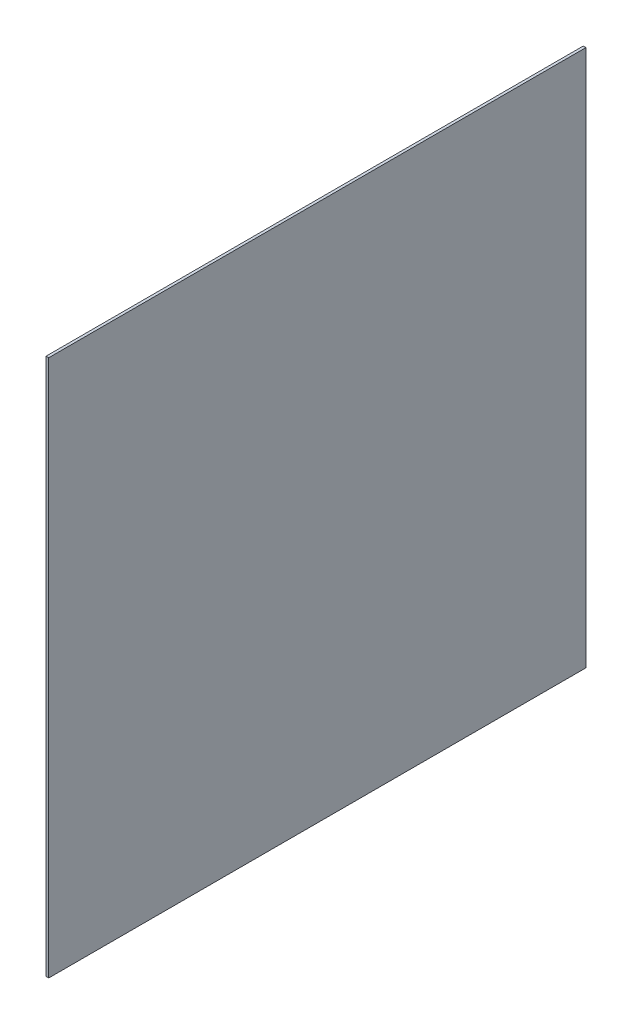
ISO-10303-21;
HEADER;
FILE_DESCRIPTION(('STEP AP214'),'2;1');
FILE_NAME('part.step','',(''),(''),'','','');
FILE_SCHEMA(('AUTOMOTIVE_DESIGN { 1 0 10303 214 1 1 1 1 }'));
ENDSEC;
DATA;
#1=APPLICATION_CONTEXT('core data for automotive mechanical design processes');
#2=APPLICATION_PROTOCOL_DEFINITION('international standard','automotive_design',2000,#1);
#3=PRODUCT_CONTEXT('',#1,'mechanical');
#4=PRODUCT('Part','Part','',(#3));
#5=PRODUCT_RELATED_PRODUCT_CATEGORY('part','',(#4));
#6=PRODUCT_DEFINITION_FORMATION('','',#4);
#7=PRODUCT_DEFINITION_CONTEXT('part definition',#1,'design');
#8=PRODUCT_DEFINITION('design','',#6,#7);
#9=PRODUCT_DEFINITION_SHAPE('','',#8);
#10=(LENGTH_UNIT() NAMED_UNIT(*) SI_UNIT(.MILLI.,.METRE.));
#11=(NAMED_UNIT(*) PLANE_ANGLE_UNIT() SI_UNIT($,.RADIAN.));
#12=(NAMED_UNIT(*) SI_UNIT($,.STERADIAN.) SOLID_ANGLE_UNIT());
#13=UNCERTAINTY_MEASURE_WITH_UNIT(LENGTH_MEASURE(1.E-05),#10,'distance_accuracy_value','');
#14=(GEOMETRIC_REPRESENTATION_CONTEXT(3) GLOBAL_UNCERTAINTY_ASSIGNED_CONTEXT((#13)) GLOBAL_UNIT_ASSIGNED_CONTEXT((#10,
#11,#12)) REPRESENTATION_CONTEXT('',''));
#15=CARTESIAN_POINT('',(0.,0.,0.));
#16=DIRECTION('',(0.,0.,1.));
#17=DIRECTION('',(1.,0.,0.));
#18=AXIS2_PLACEMENT_3D('',#15,#16,#17);
#19=CARTESIAN_POINT('',(1.,100.,100.));
#20=DIRECTION('',(0.,0.,-1.));
#21=DIRECTION('',(0.,1.,0.));
#22=AXIS2_PLACEMENT_3D('',#19,#20,#21);
#23=PLANE('',#22);
#24=DIRECTION('',(0.,-1.,0.));
#25=VECTOR('',#24,1.);
#26=CARTESIAN_POINT('',(0.,100.,100.));
#27=LINE('',#26,#25);
#28=CARTESIAN_POINT('',(0.,100.,100.));
#29=VERTEX_POINT('',#28);
#30=CARTESIAN_POINT('',(0.,-100.,100.));
#31=VERTEX_POINT('',#30);
#32=EDGE_CURVE('E97',#29,#31,#27,.T.);
#33=ORIENTED_EDGE('',*,*,#32,.T.);
#34=DIRECTION('',(-1.,0.,0.));
#35=VECTOR('',#34,1.);
#36=CARTESIAN_POINT('',(1.,-100.,100.));
#37=LINE('',#36,#35);
#38=CARTESIAN_POINT('',(1.,-100.,100.));
#39=VERTEX_POINT('',#38);
#40=EDGE_CURVE('E11',#39,#31,#37,.T.);
#41=ORIENTED_EDGE('',*,*,#40,.F.);
#42=DIRECTION('',(0.,-1.,0.));
#43=VECTOR('',#42,1.);
#44=CARTESIAN_POINT('',(1.,100.,100.));
#45=LINE('',#44,#43);
#46=CARTESIAN_POINT('',(1.,100.,100.));
#47=VERTEX_POINT('',#46);
#48=EDGE_CURVE('E85',#47,#39,#45,.T.);
#49=ORIENTED_EDGE('',*,*,#48,.F.);
#50=DIRECTION('',(-1.,0.,0.));
#51=VECTOR('',#50,1.);
#52=CARTESIAN_POINT('',(1.,100.,100.));
#53=LINE('',#52,#51);
#54=EDGE_CURVE('E93',#47,#29,#53,.T.);
#55=ORIENTED_EDGE('',*,*,#54,.T.);
#56=EDGE_LOOP('',(#33,#41,#49,#55));
#57=FACE_BOUND('',#56,.T.);
#58=ADVANCED_FACE('F34',(#57),#23,.F.);
#59=CARTESIAN_POINT('',(1.,-100.,100.));
#60=DIRECTION('',(0.,1.,0.));
#61=DIRECTION('',(0.,0.,1.));
#62=AXIS2_PLACEMENT_3D('',#59,#60,#61);
#63=PLANE('',#62);
#64=DIRECTION('',(0.,0.,-1.));
#65=VECTOR('',#64,1.);
#66=CARTESIAN_POINT('',(0.,-100.,100.));
#67=LINE('',#66,#65);
#68=CARTESIAN_POINT('',(0.,-100.,-100.));
#69=VERTEX_POINT('',#68);
#70=EDGE_CURVE('E89',#31,#69,#67,.T.);
#71=ORIENTED_EDGE('',*,*,#70,.T.);
#72=DIRECTION('',(-1.,0.,0.));
#73=VECTOR('',#72,1.);
#74=CARTESIAN_POINT('',(1.,-100.,-100.));
#75=LINE('',#74,#73);
#76=CARTESIAN_POINT('',(1.,-100.,-100.));
#77=VERTEX_POINT('',#76);
#78=EDGE_CURVE('E42',#77,#69,#75,.T.);
#79=ORIENTED_EDGE('',*,*,#78,.F.);
#80=DIRECTION('',(0.,0.,-1.));
#81=VECTOR('',#80,1.);
#82=CARTESIAN_POINT('',(1.,-100.,100.));
#83=LINE('',#82,#81);
#84=EDGE_CURVE('E80',#39,#77,#83,.T.);
#85=ORIENTED_EDGE('',*,*,#84,.F.);
#86=ORIENTED_EDGE('',*,*,#40,.T.);
#87=EDGE_LOOP('',(#71,#79,#85,#86));
#88=FACE_BOUND('',#87,.T.);
#89=ADVANCED_FACE('F88',(#88),#63,.F.);
#90=CARTESIAN_POINT('',(1.,100.,-100.));
#91=DIRECTION('',(0.,0.,1.));
#92=DIRECTION('',(0.,-1.,0.));
#93=AXIS2_PLACEMENT_3D('',#90,#91,#92);
#94=PLANE('',#93);
#95=DIRECTION('',(0.,1.,0.));
#96=VECTOR('',#95,1.);
#97=CARTESIAN_POINT('',(0.,100.,-100.));
#98=LINE('',#97,#96);
#99=CARTESIAN_POINT('',(0.,100.,-100.));
#100=VERTEX_POINT('',#99);
#101=EDGE_CURVE('E67',#69,#100,#98,.T.);
#102=ORIENTED_EDGE('',*,*,#101,.T.);
#103=DIRECTION('',(-1.,0.,0.));
#104=VECTOR('',#103,1.);
#105=CARTESIAN_POINT('',(1.,100.,-100.));
#106=LINE('',#105,#104);
#107=CARTESIAN_POINT('',(1.,100.,-100.));
#108=VERTEX_POINT('',#107);
#109=EDGE_CURVE('E90',#108,#100,#106,.T.);
#110=ORIENTED_EDGE('',*,*,#109,.F.);
#111=DIRECTION('',(0.,1.,0.));
#112=VECTOR('',#111,1.);
#113=CARTESIAN_POINT('',(1.,100.,-100.));
#114=LINE('',#113,#112);
#115=EDGE_CURVE('E83',#77,#108,#114,.T.);
#116=ORIENTED_EDGE('',*,*,#115,.F.);
#117=ORIENTED_EDGE('',*,*,#78,.T.);
#118=EDGE_LOOP('',(#102,#110,#116,#117));
#119=FACE_BOUND('',#118,.T.);
#120=ADVANCED_FACE('F91',(#119),#94,.F.);
#121=CARTESIAN_POINT('',(1.,100.,100.));
#122=DIRECTION('',(0.,-1.,0.));
#123=DIRECTION('',(0.,0.,-1.));
#124=AXIS2_PLACEMENT_3D('',#121,#122,#123);
#125=PLANE('',#124);
#126=DIRECTION('',(0.,0.,1.));
#127=VECTOR('',#126,1.);
#128=CARTESIAN_POINT('',(0.,100.,100.));
#129=LINE('',#128,#127);
#130=EDGE_CURVE('E73',#100,#29,#129,.T.);
#131=ORIENTED_EDGE('',*,*,#130,.T.);
#132=ORIENTED_EDGE('',*,*,#54,.F.);
#133=DIRECTION('',(0.,0.,1.));
#134=VECTOR('',#133,1.);
#135=CARTESIAN_POINT('',(1.,100.,100.));
#136=LINE('',#135,#134);
#137=EDGE_CURVE('E50',#108,#47,#136,.T.);
#138=ORIENTED_EDGE('',*,*,#137,.F.);
#139=ORIENTED_EDGE('',*,*,#109,.T.);
#140=EDGE_LOOP('',(#131,#132,#138,#139));
#141=FACE_BOUND('',#140,.T.);
#142=ADVANCED_FACE('F104',(#141),#125,.F.);
#143=CARTESIAN_POINT('',(1.,0.,0.));
#144=DIRECTION('',(1.,0.,0.));
#145=DIRECTION('',(0.,0.,-1.));
#146=AXIS2_PLACEMENT_3D('',#143,#144,#145);
#147=PLANE('',#146);
#148=ORIENTED_EDGE('',*,*,#48,.T.);
#149=ORIENTED_EDGE('',*,*,#84,.T.);
#150=ORIENTED_EDGE('',*,*,#115,.T.);
#151=ORIENTED_EDGE('',*,*,#137,.T.);
#152=EDGE_LOOP('',(#148,#149,#150,#151));
#153=FACE_BOUND('',#152,.T.);
#154=ADVANCED_FACE('F81',(#153),#147,.T.);
#155=CARTESIAN_POINT('',(0.,0.,0.));
#156=DIRECTION('',(1.,0.,0.));
#157=DIRECTION('',(0.,0.,-1.));
#158=AXIS2_PLACEMENT_3D('',#155,#156,#157);
#159=PLANE('',#158);
#160=ORIENTED_EDGE('',*,*,#32,.F.);
#161=ORIENTED_EDGE('',*,*,#130,.F.);
#162=ORIENTED_EDGE('',*,*,#101,.F.);
#163=ORIENTED_EDGE('',*,*,#70,.F.);
#164=EDGE_LOOP('',(#160,#161,#162,#163));
#165=FACE_BOUND('',#164,.T.);
#166=ADVANCED_FACE('F107',(#165),#159,.F.);
#167=CLOSED_SHELL('',(#58,#89,#120,#142,#154,#166));
#168=MANIFOLD_SOLID_BREP('B2',#167);
#169=ADVANCED_BREP_SHAPE_REPRESENTATION('',(#18,#168),#14);
#170=SHAPE_DEFINITION_REPRESENTATION(#9,#169);
ENDSEC;
END-ISO-10303-21;
